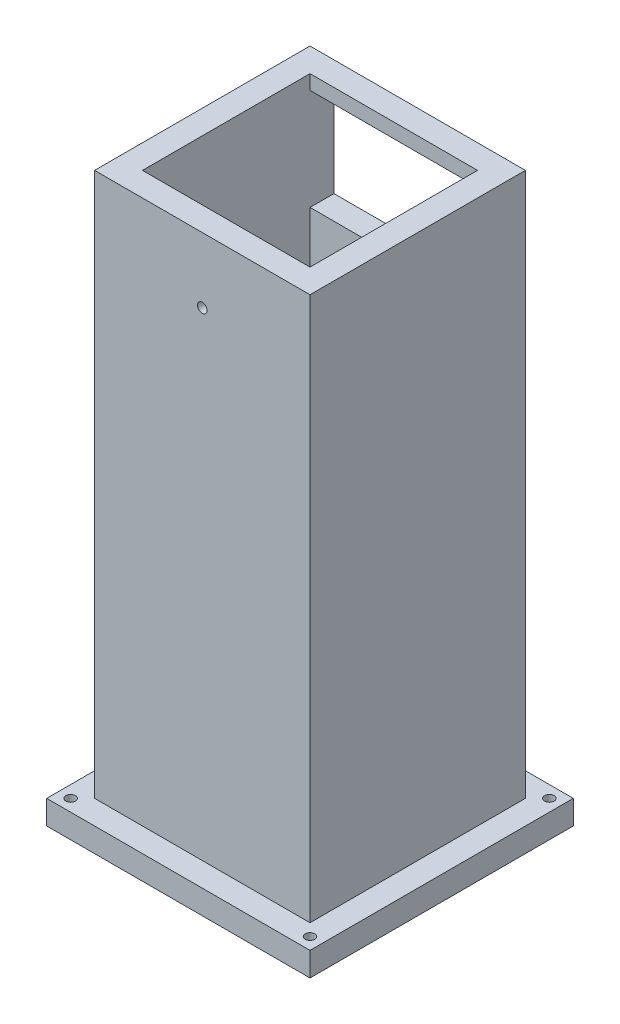
ISO-10303-21;
HEADER;
FILE_DESCRIPTION(('STEP AP214'),'2;1');
FILE_NAME('part.step','',(''),(''),'','','');
FILE_SCHEMA(('AUTOMOTIVE_DESIGN { 1 0 10303 214 1 1 1 1 }'));
ENDSEC;
DATA;
#1=APPLICATION_CONTEXT('core data for automotive mechanical design processes');
#2=APPLICATION_PROTOCOL_DEFINITION('international standard','automotive_design',2000,#1);
#3=PRODUCT_CONTEXT('',#1,'mechanical');
#4=PRODUCT('Part','Part','',(#3));
#5=PRODUCT_RELATED_PRODUCT_CATEGORY('part','',(#4));
#6=PRODUCT_DEFINITION_FORMATION('','',#4);
#7=PRODUCT_DEFINITION_CONTEXT('part definition',#1,'design');
#8=PRODUCT_DEFINITION('design','',#6,#7);
#9=PRODUCT_DEFINITION_SHAPE('','',#8);
#10=(LENGTH_UNIT() NAMED_UNIT(*) SI_UNIT(.MILLI.,.METRE.));
#11=(NAMED_UNIT(*) PLANE_ANGLE_UNIT() SI_UNIT($,.RADIAN.));
#12=(NAMED_UNIT(*) SI_UNIT($,.STERADIAN.) SOLID_ANGLE_UNIT());
#13=UNCERTAINTY_MEASURE_WITH_UNIT(LENGTH_MEASURE(1.E-05),#10,'distance_accuracy_value','');
#14=(GEOMETRIC_REPRESENTATION_CONTEXT(3) GLOBAL_UNCERTAINTY_ASSIGNED_CONTEXT((#13)) GLOBAL_UNIT_ASSIGNED_CONTEXT((#10,
#11,#12)) REPRESENTATION_CONTEXT('',''));
#15=CARTESIAN_POINT('',(0.,0.,0.));
#16=DIRECTION('',(0.,0.,1.));
#17=DIRECTION('',(1.,0.,0.));
#18=AXIS2_PLACEMENT_3D('',#15,#16,#17);
#19=CARTESIAN_POINT('',(-17.5,0.,-17.5));
#20=DIRECTION('',(0.,0.,1.));
#21=DIRECTION('',(1.,0.,0.));
#22=AXIS2_PLACEMENT_3D('',#19,#20,#21);
#23=PLANE('',#22);
#24=DIRECTION('',(1.,0.,0.));
#25=VECTOR('',#24,1.);
#26=CARTESIAN_POINT('',(-17.5,273.612120728358,-17.5));
#27=LINE('',#26,#25);
#28=CARTESIAN_POINT('',(-17.5,273.612120728358,-17.5));
#29=VERTEX_POINT('',#28);
#30=CARTESIAN_POINT('',(17.5,273.612120728358,-17.5));
#31=VERTEX_POINT('',#30);
#32=EDGE_CURVE('E228',#29,#31,#27,.T.);
#33=ORIENTED_EDGE('',*,*,#32,.F.);
#34=DIRECTION('',(0.,1.,0.));
#35=VECTOR('',#34,1.);
#36=CARTESIAN_POINT('',(-17.5,0.,-17.5));
#37=LINE('',#36,#35);
#38=CARTESIAN_POINT('',(-17.5,270.587205010945,-17.5));
#39=VERTEX_POINT('',#38);
#40=EDGE_CURVE('E260',#39,#29,#37,.T.);
#41=ORIENTED_EDGE('',*,*,#40,.F.);
#42=DIRECTION('',(1.,0.,0.));
#43=VECTOR('',#42,1.);
#44=CARTESIAN_POINT('',(-17.5,270.587205010945,-17.5));
#45=LINE('',#44,#43);
#46=CARTESIAN_POINT('',(17.5,270.587205010945,-17.5));
#47=VERTEX_POINT('',#46);
#48=EDGE_CURVE('E274',#39,#47,#45,.T.);
#49=ORIENTED_EDGE('',*,*,#48,.T.);
#50=DIRECTION('',(0.,1.,0.));
#51=VECTOR('',#50,1.);
#52=CARTESIAN_POINT('',(17.5,0.,-17.5));
#53=LINE('',#52,#51);
#54=EDGE_CURVE('E257',#47,#31,#53,.T.);
#55=ORIENTED_EDGE('',*,*,#54,.T.);
#56=EDGE_LOOP('',(#33,#41,#49,#55));
#57=FACE_BOUND('',#56,.T.);
#58=ADVANCED_FACE('F39',(#57),#23,.T.);
#59=CARTESIAN_POINT('',(22.5,300.,22.5));
#60=DIRECTION('',(-1.,0.,0.));
#61=DIRECTION('',(0.,0.,1.));
#62=AXIS2_PLACEMENT_3D('',#59,#60,#61);
#63=PLANE('',#62);
#64=DIRECTION('',(0.,-1.,0.));
#65=VECTOR('',#64,1.);
#66=CARTESIAN_POINT('',(22.5,300.,22.5));
#67=LINE('',#66,#65);
#68=CARTESIAN_POINT('',(22.5,273.612120728358,22.5));
#69=VERTEX_POINT('',#68);
#70=CARTESIAN_POINT('',(22.5,160.,22.5));
#71=VERTEX_POINT('',#70);
#72=EDGE_CURVE('E263',#69,#71,#67,.T.);
#73=ORIENTED_EDGE('',*,*,#72,.T.);
#74=DIRECTION('',(0.,0.,1.));
#75=VECTOR('',#74,1.);
#76=CARTESIAN_POINT('',(22.5,160.,22.5));
#77=LINE('',#76,#75);
#78=CARTESIAN_POINT('',(22.5,160.,-22.5));
#79=VERTEX_POINT('',#78);
#80=EDGE_CURVE('E193',#79,#71,#77,.T.);
#81=ORIENTED_EDGE('',*,*,#80,.F.);
#82=DIRECTION('',(0.,-1.,0.));
#83=VECTOR('',#82,1.);
#84=CARTESIAN_POINT('',(22.5,300.,-22.5));
#85=LINE('',#84,#83);
#86=CARTESIAN_POINT('',(22.5,273.612120728358,-22.5));
#87=VERTEX_POINT('',#86);
#88=EDGE_CURVE('E271',#87,#79,#85,.T.);
#89=ORIENTED_EDGE('',*,*,#88,.F.);
#90=DIRECTION('',(0.,0.,1.));
#91=VECTOR('',#90,1.);
#92=CARTESIAN_POINT('',(22.5,273.612120728358,-22.5));
#93=LINE('',#92,#91);
#94=EDGE_CURVE('E220',#87,#69,#93,.T.);
#95=ORIENTED_EDGE('',*,*,#94,.T.);
#96=EDGE_LOOP('',(#73,#81,#89,#95));
#97=FACE_BOUND('',#96,.T.);
#98=ADVANCED_FACE('F41',(#97),#63,.F.);
#99=CARTESIAN_POINT('',(-22.5,300.,-22.5));
#100=DIRECTION('',(0.,0.,1.));
#101=DIRECTION('',(1.,0.,0.));
#102=AXIS2_PLACEMENT_3D('',#99,#100,#101);
#103=PLANE('',#102);
#104=DIRECTION('',(0.,1.,0.));
#105=VECTOR('',#104,1.);
#106=CARTESIAN_POINT('',(-17.5,249.412794989055,-22.5));
#107=LINE('',#106,#105);
#108=CARTESIAN_POINT('',(-17.5,249.412794989055,-22.5));
#109=VERTEX_POINT('',#108);
#110=CARTESIAN_POINT('',(-17.5,270.587205010945,-22.5));
#111=VERTEX_POINT('',#110);
#112=EDGE_CURVE('E236',#109,#111,#107,.T.);
#113=ORIENTED_EDGE('',*,*,#112,.F.);
#114=DIRECTION('',(-1.,0.,0.));
#115=VECTOR('',#114,1.);
#116=CARTESIAN_POINT('',(17.5,249.412794989055,-22.5));
#117=LINE('',#116,#115);
#118=CARTESIAN_POINT('',(17.5,249.412794989055,-22.5));
#119=VERTEX_POINT('',#118);
#120=EDGE_CURVE('E234',#119,#109,#117,.T.);
#121=ORIENTED_EDGE('',*,*,#120,.F.);
#122=DIRECTION('',(0.,1.,0.));
#123=VECTOR('',#122,1.);
#124=CARTESIAN_POINT('',(17.5,249.412794989055,-22.5));
#125=LINE('',#124,#123);
#126=CARTESIAN_POINT('',(17.5,270.587205010945,-22.5));
#127=VERTEX_POINT('',#126);
#128=EDGE_CURVE('E242',#119,#127,#125,.T.);
#129=ORIENTED_EDGE('',*,*,#128,.T.);
#130=DIRECTION('',(-1.,0.,0.));
#131=VECTOR('',#130,1.);
#132=CARTESIAN_POINT('',(17.5,270.587205010945,-22.5));
#133=LINE('',#132,#131);
#134=EDGE_CURVE('E239',#127,#111,#133,.T.);
#135=ORIENTED_EDGE('',*,*,#134,.T.);
#136=EDGE_LOOP('',(#113,#121,#129,#135));
#137=FACE_BOUND('',#136,.T.);
#138=ORIENTED_EDGE('',*,*,#88,.T.);
#139=DIRECTION('',(1.,0.,0.));
#140=VECTOR('',#139,1.);
#141=CARTESIAN_POINT('',(-22.5,160.,-22.5));
#142=LINE('',#141,#140);
#143=CARTESIAN_POINT('',(-22.5,160.,-22.5));
#144=VERTEX_POINT('',#143);
#145=EDGE_CURVE('E202',#144,#79,#142,.T.);
#146=ORIENTED_EDGE('',*,*,#145,.F.);
#147=DIRECTION('',(0.,-1.,0.));
#148=VECTOR('',#147,1.);
#149=CARTESIAN_POINT('',(-22.5,300.,-22.5));
#150=LINE('',#149,#148);
#151=CARTESIAN_POINT('',(-22.5,273.612120728358,-22.5));
#152=VERTEX_POINT('',#151);
#153=EDGE_CURVE('E268',#152,#144,#150,.T.);
#154=ORIENTED_EDGE('',*,*,#153,.F.);
#155=DIRECTION('',(1.,0.,0.));
#156=VECTOR('',#155,1.);
#157=CARTESIAN_POINT('',(-22.5,273.612120728358,-22.5));
#158=LINE('',#157,#156);
#159=EDGE_CURVE('E216',#152,#87,#158,.T.);
#160=ORIENTED_EDGE('',*,*,#159,.T.);
#161=EDGE_LOOP('',(#138,#146,#154,#160));
#162=FACE_BOUND('',#161,.T.);
#163=ADVANCED_FACE('F309',(#137,#162),#103,.F.);
#164=CARTESIAN_POINT('',(-22.5,300.,22.5));
#165=DIRECTION('',(1.,0.,0.));
#166=DIRECTION('',(0.,0.,-1.));
#167=AXIS2_PLACEMENT_3D('',#164,#165,#166);
#168=PLANE('',#167);
#169=ORIENTED_EDGE('',*,*,#153,.T.);
#170=DIRECTION('',(0.,0.,1.));
#171=VECTOR('',#170,1.);
#172=CARTESIAN_POINT('',(-22.5,160.,22.5));
#173=LINE('',#172,#171);
#174=CARTESIAN_POINT('',(-22.5,160.,22.5));
#175=VERTEX_POINT('',#174);
#176=EDGE_CURVE('E200',#144,#175,#173,.T.);
#177=ORIENTED_EDGE('',*,*,#176,.T.);
#178=DIRECTION('',(0.,-1.,0.));
#179=VECTOR('',#178,1.);
#180=CARTESIAN_POINT('',(-22.5,300.,22.5));
#181=LINE('',#180,#179);
#182=CARTESIAN_POINT('',(-22.5,273.612120728358,22.5));
#183=VERTEX_POINT('',#182);
#184=EDGE_CURVE('E265',#183,#175,#181,.T.);
#185=ORIENTED_EDGE('',*,*,#184,.F.);
#186=DIRECTION('',(0.,0.,1.));
#187=VECTOR('',#186,1.);
#188=CARTESIAN_POINT('',(-22.5,273.612120728358,-22.5));
#189=LINE('',#188,#187);
#190=EDGE_CURVE('E54',#152,#183,#189,.T.);
#191=ORIENTED_EDGE('',*,*,#190,.F.);
#192=EDGE_LOOP('',(#169,#177,#185,#191));
#193=FACE_BOUND('',#192,.T.);
#194=ADVANCED_FACE('F384',(#193),#168,.F.);
#195=CARTESIAN_POINT('',(-22.5,300.,22.5));
#196=DIRECTION('',(0.,0.,-1.));
#197=DIRECTION('',(-1.,0.,0.));
#198=AXIS2_PLACEMENT_3D('',#195,#196,#197);
#199=PLANE('',#198);
#200=CARTESIAN_POINT('',(0.,260.,22.5));
#201=DIRECTION('',(0.,0.,1.));
#202=DIRECTION('',(1.,0.,0.));
#203=AXIS2_PLACEMENT_3D('',#200,#201,#202);
#204=CIRCLE('',#203,1.);
#205=CARTESIAN_POINT('',(1.,260.,22.5));
#206=VERTEX_POINT('',#205);
#207=EDGE_CURVE('E230',#206,#206,#204,.T.);
#208=ORIENTED_EDGE('',*,*,#207,.F.);
#209=EDGE_LOOP('',(#208));
#210=FACE_BOUND('',#209,.T.);
#211=ORIENTED_EDGE('',*,*,#184,.T.);
#212=DIRECTION('',(1.,0.,0.));
#213=VECTOR('',#212,1.);
#214=CARTESIAN_POINT('',(-22.5,160.,22.5));
#215=LINE('',#214,#213);
#216=EDGE_CURVE('E203',#175,#71,#215,.T.);
#217=ORIENTED_EDGE('',*,*,#216,.T.);
#218=ORIENTED_EDGE('',*,*,#72,.F.);
#219=DIRECTION('',(1.,0.,0.));
#220=VECTOR('',#219,1.);
#221=CARTESIAN_POINT('',(-22.5,273.612120728358,22.5));
#222=LINE('',#221,#220);
#223=EDGE_CURVE('E215',#183,#69,#222,.T.);
#224=ORIENTED_EDGE('',*,*,#223,.F.);
#225=EDGE_LOOP('',(#211,#217,#218,#224));
#226=FACE_BOUND('',#225,.T.);
#227=ADVANCED_FACE('F381',(#210,#226),#199,.F.);
#228=CARTESIAN_POINT('',(-17.5,0.,17.5));
#229=DIRECTION('',(1.,0.,0.));
#230=DIRECTION('',(0.,0.,-1.));
#231=AXIS2_PLACEMENT_3D('',#228,#229,#230);
#232=PLANE('',#231);
#233=DIRECTION('',(0.,0.,1.));
#234=VECTOR('',#233,1.);
#235=CARTESIAN_POINT('',(-17.5,160.,17.5));
#236=LINE('',#235,#234);
#237=CARTESIAN_POINT('',(-17.5,160.,-17.5));
#238=VERTEX_POINT('',#237);
#239=CARTESIAN_POINT('',(-17.5,160.,17.5));
#240=VERTEX_POINT('',#239);
#241=EDGE_CURVE('E210',#238,#240,#236,.T.);
#242=ORIENTED_EDGE('',*,*,#241,.F.);
#243=CARTESIAN_POINT('',(-17.5,249.412794989055,-17.5));
#244=VERTEX_POINT('',#243);
#245=EDGE_CURVE('E261',#238,#244,#37,.T.);
#246=ORIENTED_EDGE('',*,*,#245,.T.);
#247=DIRECTION('',(0.,0.,-1.));
#248=VECTOR('',#247,1.);
#249=CARTESIAN_POINT('',(-17.5,249.412794989055,-12.5));
#250=LINE('',#249,#248);
#251=EDGE_CURVE('E245',#244,#109,#250,.T.);
#252=ORIENTED_EDGE('',*,*,#251,.T.);
#253=ORIENTED_EDGE('',*,*,#112,.T.);
#254=DIRECTION('',(0.,0.,-1.));
#255=VECTOR('',#254,1.);
#256=CARTESIAN_POINT('',(-17.5,270.587205010945,-12.5));
#257=LINE('',#256,#255);
#258=EDGE_CURVE('E251',#39,#111,#257,.T.);
#259=ORIENTED_EDGE('',*,*,#258,.F.);
#260=ORIENTED_EDGE('',*,*,#40,.T.);
#261=DIRECTION('',(0.,0.,-1.));
#262=VECTOR('',#261,1.);
#263=CARTESIAN_POINT('',(-17.5,273.612120728358,17.5));
#264=LINE('',#263,#262);
#265=CARTESIAN_POINT('',(-17.5,273.612120728358,17.5));
#266=VERTEX_POINT('',#265);
#267=EDGE_CURVE('E226',#266,#29,#264,.T.);
#268=ORIENTED_EDGE('',*,*,#267,.F.);
#269=DIRECTION('',(0.,1.,0.));
#270=VECTOR('',#269,1.);
#271=CARTESIAN_POINT('',(-17.5,0.,17.5));
#272=LINE('',#271,#270);
#273=EDGE_CURVE('E248',#240,#266,#272,.T.);
#274=ORIENTED_EDGE('',*,*,#273,.F.);
#275=EDGE_LOOP('',(#242,#246,#252,#253,#259,#260,#268,#274));
#276=FACE_BOUND('',#275,.T.);
#277=ADVANCED_FACE('F293',(#276),#232,.T.);
#278=CARTESIAN_POINT('',(17.5,0.,17.5));
#279=DIRECTION('',(1.,0.,0.));
#280=DIRECTION('',(0.,0.,-1.));
#281=AXIS2_PLACEMENT_3D('',#278,#279,#280);
#282=PLANE('',#281);
#283=CARTESIAN_POINT('',(17.5,160.,-17.5));
#284=VERTEX_POINT('',#283);
#285=CARTESIAN_POINT('',(17.5,249.412794989055,-17.5));
#286=VERTEX_POINT('',#285);
#287=EDGE_CURVE('E258',#284,#286,#53,.T.);
#288=ORIENTED_EDGE('',*,*,#287,.F.);
#289=DIRECTION('',(0.,0.,1.));
#290=VECTOR('',#289,1.);
#291=CARTESIAN_POINT('',(17.5,160.,17.5));
#292=LINE('',#291,#290);
#293=CARTESIAN_POINT('',(17.5,160.,17.5));
#294=VERTEX_POINT('',#293);
#295=EDGE_CURVE('E206',#284,#294,#292,.T.);
#296=ORIENTED_EDGE('',*,*,#295,.T.);
#297=DIRECTION('',(0.,1.,0.));
#298=VECTOR('',#297,1.);
#299=CARTESIAN_POINT('',(17.5,0.,17.5));
#300=LINE('',#299,#298);
#301=CARTESIAN_POINT('',(17.5,273.612120728358,17.5));
#302=VERTEX_POINT('',#301);
#303=EDGE_CURVE('E62',#294,#302,#300,.T.);
#304=ORIENTED_EDGE('',*,*,#303,.T.);
#305=DIRECTION('',(0.,0.,-1.));
#306=VECTOR('',#305,1.);
#307=CARTESIAN_POINT('',(17.5,273.612120728358,17.5));
#308=LINE('',#307,#306);
#309=EDGE_CURVE('E223',#302,#31,#308,.T.);
#310=ORIENTED_EDGE('',*,*,#309,.T.);
#311=ORIENTED_EDGE('',*,*,#54,.F.);
#312=DIRECTION('',(0.,0.,-1.));
#313=VECTOR('',#312,1.);
#314=CARTESIAN_POINT('',(17.5,270.587205010945,-12.5));
#315=LINE('',#314,#313);
#316=EDGE_CURVE('E249',#47,#127,#315,.T.);
#317=ORIENTED_EDGE('',*,*,#316,.T.);
#318=ORIENTED_EDGE('',*,*,#128,.F.);
#319=DIRECTION('',(0.,0.,-1.));
#320=VECTOR('',#319,1.);
#321=CARTESIAN_POINT('',(17.5,249.412794989055,-12.5));
#322=LINE('',#321,#320);
#323=EDGE_CURVE('E246',#286,#119,#322,.T.);
#324=ORIENTED_EDGE('',*,*,#323,.F.);
#325=EDGE_LOOP('',(#288,#296,#304,#310,#311,#317,#318,#324));
#326=FACE_BOUND('',#325,.T.);
#327=ADVANCED_FACE('F300',(#326),#282,.F.);
#328=CARTESIAN_POINT('',(-17.5,0.,17.5));
#329=DIRECTION('',(0.,0.,1.));
#330=DIRECTION('',(1.,0.,0.));
#331=AXIS2_PLACEMENT_3D('',#328,#329,#330);
#332=PLANE('',#331);
#333=CARTESIAN_POINT('',(0.,260.,17.5));
#334=DIRECTION('',(0.,0.,1.));
#335=DIRECTION('',(1.,0.,0.));
#336=AXIS2_PLACEMENT_3D('',#333,#334,#335);
#337=CIRCLE('',#336,1.);
#338=CARTESIAN_POINT('',(1.,260.,17.5));
#339=VERTEX_POINT('',#338);
#340=EDGE_CURVE('E233',#339,#339,#337,.T.);
#341=ORIENTED_EDGE('',*,*,#340,.T.);
#342=EDGE_LOOP('',(#341));
#343=FACE_BOUND('',#342,.T.);
#344=ORIENTED_EDGE('',*,*,#303,.F.);
#345=DIRECTION('',(-1.,0.,0.));
#346=VECTOR('',#345,1.);
#347=CARTESIAN_POINT('',(-17.5,160.,17.5));
#348=LINE('',#347,#346);
#349=EDGE_CURVE('E212',#294,#240,#348,.T.);
#350=ORIENTED_EDGE('',*,*,#349,.T.);
#351=ORIENTED_EDGE('',*,*,#273,.T.);
#352=DIRECTION('',(1.,0.,0.));
#353=VECTOR('',#352,1.);
#354=CARTESIAN_POINT('',(-17.5,273.612120728358,17.5));
#355=LINE('',#354,#353);
#356=EDGE_CURVE('E47',#266,#302,#355,.T.);
#357=ORIENTED_EDGE('',*,*,#356,.T.);
#358=EDGE_LOOP('',(#344,#350,#351,#357));
#359=FACE_BOUND('',#358,.T.);
#360=ADVANCED_FACE('F284',(#343,#359),#332,.F.);
#361=DIRECTION('',(-1.,0.,0.));
#362=VECTOR('',#361,1.);
#363=CARTESIAN_POINT('',(-17.5,160.,-17.5));
#364=LINE('',#363,#362);
#365=EDGE_CURVE('E11',#284,#238,#364,.T.);
#366=ORIENTED_EDGE('',*,*,#365,.F.);
#367=ORIENTED_EDGE('',*,*,#287,.T.);
#368=DIRECTION('',(1.,0.,0.));
#369=VECTOR('',#368,1.);
#370=CARTESIAN_POINT('',(-17.5,249.412794989055,-17.5));
#371=LINE('',#370,#369);
#372=EDGE_CURVE('E277',#244,#286,#371,.T.);
#373=ORIENTED_EDGE('',*,*,#372,.F.);
#374=ORIENTED_EDGE('',*,*,#245,.F.);
#375=EDGE_LOOP('',(#366,#367,#373,#374));
#376=FACE_BOUND('',#375,.T.);
#377=ADVANCED_FACE('F318',(#376),#23,.T.);
#378=CARTESIAN_POINT('',(17.5,249.412794989055,-12.5));
#379=DIRECTION('',(0.,-1.,0.));
#380=DIRECTION('',(0.,0.,-1.));
#381=AXIS2_PLACEMENT_3D('',#378,#379,#380);
#382=PLANE('',#381);
#383=ORIENTED_EDGE('',*,*,#372,.T.);
#384=ORIENTED_EDGE('',*,*,#323,.T.);
#385=ORIENTED_EDGE('',*,*,#120,.T.);
#386=ORIENTED_EDGE('',*,*,#251,.F.);
#387=EDGE_LOOP('',(#383,#384,#385,#386));
#388=FACE_BOUND('',#387,.T.);
#389=ADVANCED_FACE('F313',(#388),#382,.F.);
#390=CARTESIAN_POINT('',(17.5,270.587205010945,-12.5));
#391=DIRECTION('',(0.,-1.,0.));
#392=DIRECTION('',(0.,0.,-1.));
#393=AXIS2_PLACEMENT_3D('',#390,#391,#392);
#394=PLANE('',#393);
#395=ORIENTED_EDGE('',*,*,#258,.T.);
#396=ORIENTED_EDGE('',*,*,#134,.F.);
#397=ORIENTED_EDGE('',*,*,#316,.F.);
#398=ORIENTED_EDGE('',*,*,#48,.F.);
#399=EDGE_LOOP('',(#395,#396,#397,#398));
#400=FACE_BOUND('',#399,.T.);
#401=ADVANCED_FACE('F306',(#400),#394,.T.);
#402=CARTESIAN_POINT('',(0.,260.,12.5));
#403=DIRECTION('',(0.,0.,1.));
#404=DIRECTION('',(1.,0.,0.));
#405=AXIS2_PLACEMENT_3D('',#402,#403,#404);
#406=CYLINDRICAL_SURFACE('',#405,1.);
#407=ORIENTED_EDGE('',*,*,#207,.T.);
#408=EDGE_LOOP('',(#407));
#409=FACE_BOUND('',#408,.T.);
#410=ORIENTED_EDGE('',*,*,#340,.F.);
#411=EDGE_LOOP('',(#410));
#412=FACE_BOUND('',#411,.T.);
#413=ADVANCED_FACE('F329',(#409,#412),#406,.F.);
#414=CARTESIAN_POINT('',(-22.5,273.612120728358,-22.5));
#415=DIRECTION('',(0.,-1.,0.));
#416=DIRECTION('',(0.,0.,-1.));
#417=AXIS2_PLACEMENT_3D('',#414,#415,#416);
#418=PLANE('',#417);
#419=ORIENTED_EDGE('',*,*,#32,.T.);
#420=ORIENTED_EDGE('',*,*,#309,.F.);
#421=ORIENTED_EDGE('',*,*,#356,.F.);
#422=ORIENTED_EDGE('',*,*,#267,.T.);
#423=EDGE_LOOP('',(#419,#420,#421,#422));
#424=FACE_BOUND('',#423,.T.);
#425=ORIENTED_EDGE('',*,*,#223,.T.);
#426=ORIENTED_EDGE('',*,*,#94,.F.);
#427=ORIENTED_EDGE('',*,*,#159,.F.);
#428=ORIENTED_EDGE('',*,*,#190,.T.);
#429=EDGE_LOOP('',(#425,#426,#427,#428));
#430=FACE_BOUND('',#429,.T.);
#431=ADVANCED_FACE('F288',(#424,#430),#418,.F.);
#432=CARTESIAN_POINT('',(0.,160.,0.));
#433=DIRECTION('',(0.,1.,0.));
#434=DIRECTION('',(0.,0.,1.));
#435=AXIS2_PLACEMENT_3D('',#432,#433,#434);
#436=PLANE('',#435);
#437=ORIENTED_EDGE('',*,*,#295,.F.);
#438=ORIENTED_EDGE('',*,*,#365,.T.);
#439=ORIENTED_EDGE('',*,*,#241,.T.);
#440=ORIENTED_EDGE('',*,*,#349,.F.);
#441=EDGE_LOOP('',(#437,#438,#439,#440));
#442=FACE_BOUND('',#441,.T.);
#443=ADVANCED_FACE('F320',(#442),#436,.T.);
#444=CARTESIAN_POINT('',(25.,160.,-25.));
#445=DIRECTION('',(0.,1.,0.));
#446=DIRECTION('',(0.,0.,1.));
#447=AXIS2_PLACEMENT_3D('',#444,#445,#446);
#448=CIRCLE('',#447,1.);
#449=CARTESIAN_POINT('',(25.,160.,-24.));
#450=VERTEX_POINT('',#449);
#451=EDGE_CURVE('E182',#450,#450,#448,.T.);
#452=ORIENTED_EDGE('',*,*,#451,.F.);
#453=EDGE_LOOP('',(#452));
#454=FACE_BOUND('',#453,.T.);
#455=CARTESIAN_POINT('',(-25.,160.,-25.));
#456=DIRECTION('',(0.,1.,0.));
#457=DIRECTION('',(0.,0.,1.));
#458=AXIS2_PLACEMENT_3D('',#455,#456,#457);
#459=CIRCLE('',#458,1.);
#460=CARTESIAN_POINT('',(-25.,160.,-24.));
#461=VERTEX_POINT('',#460);
#462=EDGE_CURVE('E604',#461,#461,#459,.T.);
#463=ORIENTED_EDGE('',*,*,#462,.F.);
#464=EDGE_LOOP('',(#463));
#465=FACE_BOUND('',#464,.T.);
#466=CARTESIAN_POINT('',(-25.,160.,25.));
#467=DIRECTION('',(0.,1.,0.));
#468=DIRECTION('',(0.,0.,1.));
#469=AXIS2_PLACEMENT_3D('',#466,#467,#468);
#470=CIRCLE('',#469,1.);
#471=CARTESIAN_POINT('',(-25.,160.,26.));
#472=VERTEX_POINT('',#471);
#473=EDGE_CURVE('E602',#472,#472,#470,.T.);
#474=ORIENTED_EDGE('',*,*,#473,.F.);
#475=EDGE_LOOP('',(#474));
#476=FACE_BOUND('',#475,.T.);
#477=CARTESIAN_POINT('',(25.,160.,25.));
#478=DIRECTION('',(0.,1.,0.));
#479=DIRECTION('',(0.,0.,1.));
#480=AXIS2_PLACEMENT_3D('',#477,#478,#479);
#481=CIRCLE('',#480,1.);
#482=CARTESIAN_POINT('',(25.,160.,26.));
#483=VERTEX_POINT('',#482);
#484=EDGE_CURVE('E599',#483,#483,#481,.T.);
#485=ORIENTED_EDGE('',*,*,#484,.F.);
#486=EDGE_LOOP('',(#485));
#487=FACE_BOUND('',#486,.T.);
#488=DIRECTION('',(0.,0.,1.));
#489=VECTOR('',#488,1.);
#490=CARTESIAN_POINT('',(-27.5,160.,-27.5));
#491=LINE('',#490,#489);
#492=CARTESIAN_POINT('',(-27.5,160.,-27.5));
#493=VERTEX_POINT('',#492);
#494=CARTESIAN_POINT('',(-27.5,160.,27.5));
#495=VERTEX_POINT('',#494);
#496=EDGE_CURVE('E187',#493,#495,#491,.T.);
#497=ORIENTED_EDGE('',*,*,#496,.T.);
#498=DIRECTION('',(1.,0.,0.));
#499=VECTOR('',#498,1.);
#500=CARTESIAN_POINT('',(-27.5,160.,27.5));
#501=LINE('',#500,#499);
#502=CARTESIAN_POINT('',(27.5,160.,27.5));
#503=VERTEX_POINT('',#502);
#504=EDGE_CURVE('E158',#495,#503,#501,.T.);
#505=ORIENTED_EDGE('',*,*,#504,.T.);
#506=DIRECTION('',(0.,0.,1.));
#507=VECTOR('',#506,1.);
#508=CARTESIAN_POINT('',(27.5,160.,-27.5));
#509=LINE('',#508,#507);
#510=CARTESIAN_POINT('',(27.5,160.,-27.5));
#511=VERTEX_POINT('',#510);
#512=EDGE_CURVE('E179',#511,#503,#509,.T.);
#513=ORIENTED_EDGE('',*,*,#512,.F.);
#514=DIRECTION('',(1.,0.,0.));
#515=VECTOR('',#514,1.);
#516=CARTESIAN_POINT('',(-27.5,160.,-27.5));
#517=LINE('',#516,#515);
#518=EDGE_CURVE('E177',#493,#511,#517,.T.);
#519=ORIENTED_EDGE('',*,*,#518,.F.);
#520=EDGE_LOOP('',(#497,#505,#513,#519));
#521=FACE_BOUND('',#520,.T.);
#522=ORIENTED_EDGE('',*,*,#216,.F.);
#523=ORIENTED_EDGE('',*,*,#176,.F.);
#524=ORIENTED_EDGE('',*,*,#145,.T.);
#525=ORIENTED_EDGE('',*,*,#80,.T.);
#526=EDGE_LOOP('',(#522,#523,#524,#525));
#527=FACE_BOUND('',#526,.T.);
#528=ADVANCED_FACE('F322',(#454,#465,#476,#487,#521,#527),#436,.T.);
#529=CARTESIAN_POINT('',(-27.5,155.,-27.5));
#530=DIRECTION('',(-1.,0.,0.));
#531=DIRECTION('',(0.,0.,1.));
#532=AXIS2_PLACEMENT_3D('',#529,#530,#531);
#533=PLANE('',#532);
#534=ORIENTED_EDGE('',*,*,#496,.F.);
#535=DIRECTION('',(0.,1.,0.));
#536=VECTOR('',#535,1.);
#537=CARTESIAN_POINT('',(-27.5,155.,-27.5));
#538=LINE('',#537,#536);
#539=CARTESIAN_POINT('',(-27.5,155.,-27.5));
#540=VERTEX_POINT('',#539);
#541=EDGE_CURVE('E175',#540,#493,#538,.T.);
#542=ORIENTED_EDGE('',*,*,#541,.F.);
#543=DIRECTION('',(0.,0.,1.));
#544=VECTOR('',#543,1.);
#545=CARTESIAN_POINT('',(-27.5,155.,-27.5));
#546=LINE('',#545,#544);
#547=CARTESIAN_POINT('',(-27.5,155.,27.5));
#548=VERTEX_POINT('',#547);
#549=EDGE_CURVE('E169',#540,#548,#546,.T.);
#550=ORIENTED_EDGE('',*,*,#549,.T.);
#551=DIRECTION('',(0.,1.,0.));
#552=VECTOR('',#551,1.);
#553=CARTESIAN_POINT('',(-27.5,155.,27.5));
#554=LINE('',#553,#552);
#555=EDGE_CURVE('E153',#548,#495,#554,.T.);
#556=ORIENTED_EDGE('',*,*,#555,.T.);
#557=EDGE_LOOP('',(#534,#542,#550,#556));
#558=FACE_BOUND('',#557,.T.);
#559=ADVANCED_FACE('F174',(#558),#533,.T.);
#560=CARTESIAN_POINT('',(-27.5,155.,-27.5));
#561=DIRECTION('',(0.,0.,1.));
#562=DIRECTION('',(1.,0.,0.));
#563=AXIS2_PLACEMENT_3D('',#560,#561,#562);
#564=PLANE('',#563);
#565=ORIENTED_EDGE('',*,*,#518,.T.);
#566=DIRECTION('',(0.,1.,0.));
#567=VECTOR('',#566,1.);
#568=CARTESIAN_POINT('',(27.5,155.,-27.5));
#569=LINE('',#568,#567);
#570=CARTESIAN_POINT('',(27.5,155.,-27.5));
#571=VERTEX_POINT('',#570);
#572=EDGE_CURVE('E194',#571,#511,#569,.T.);
#573=ORIENTED_EDGE('',*,*,#572,.F.);
#574=DIRECTION('',(1.,0.,0.));
#575=VECTOR('',#574,1.);
#576=CARTESIAN_POINT('',(-27.5,155.,-27.5));
#577=LINE('',#576,#575);
#578=EDGE_CURVE('E164',#540,#571,#577,.T.);
#579=ORIENTED_EDGE('',*,*,#578,.F.);
#580=ORIENTED_EDGE('',*,*,#541,.T.);
#581=EDGE_LOOP('',(#565,#573,#579,#580));
#582=FACE_BOUND('',#581,.T.);
#583=ADVANCED_FACE('F362',(#582),#564,.F.);
#584=CARTESIAN_POINT('',(27.5,155.,-27.5));
#585=DIRECTION('',(-1.,0.,0.));
#586=DIRECTION('',(0.,0.,1.));
#587=AXIS2_PLACEMENT_3D('',#584,#585,#586);
#588=PLANE('',#587);
#589=ORIENTED_EDGE('',*,*,#512,.T.);
#590=DIRECTION('',(0.,1.,0.));
#591=VECTOR('',#590,1.);
#592=CARTESIAN_POINT('',(27.5,155.,27.5));
#593=LINE('',#592,#591);
#594=CARTESIAN_POINT('',(27.5,155.,27.5));
#595=VERTEX_POINT('',#594);
#596=EDGE_CURVE('E163',#595,#503,#593,.T.);
#597=ORIENTED_EDGE('',*,*,#596,.F.);
#598=DIRECTION('',(0.,0.,1.));
#599=VECTOR('',#598,1.);
#600=CARTESIAN_POINT('',(27.5,155.,-27.5));
#601=LINE('',#600,#599);
#602=EDGE_CURVE('E171',#571,#595,#601,.T.);
#603=ORIENTED_EDGE('',*,*,#602,.F.);
#604=ORIENTED_EDGE('',*,*,#572,.T.);
#605=EDGE_LOOP('',(#589,#597,#603,#604));
#606=FACE_BOUND('',#605,.T.);
#607=ADVANCED_FACE('F365',(#606),#588,.F.);
#608=CARTESIAN_POINT('',(-27.5,155.,27.5));
#609=DIRECTION('',(0.,0.,1.));
#610=DIRECTION('',(1.,0.,0.));
#611=AXIS2_PLACEMENT_3D('',#608,#609,#610);
#612=PLANE('',#611);
#613=ORIENTED_EDGE('',*,*,#504,.F.);
#614=ORIENTED_EDGE('',*,*,#555,.F.);
#615=DIRECTION('',(1.,0.,0.));
#616=VECTOR('',#615,1.);
#617=CARTESIAN_POINT('',(-27.5,155.,27.5));
#618=LINE('',#617,#616);
#619=EDGE_CURVE('E156',#548,#595,#618,.T.);
#620=ORIENTED_EDGE('',*,*,#619,.T.);
#621=ORIENTED_EDGE('',*,*,#596,.T.);
#622=EDGE_LOOP('',(#613,#614,#620,#621));
#623=FACE_BOUND('',#622,.T.);
#624=ADVANCED_FACE('F155',(#623),#612,.T.);
#625=CARTESIAN_POINT('',(0.,155.,0.));
#626=DIRECTION('',(0.,1.,0.));
#627=DIRECTION('',(0.,0.,1.));
#628=AXIS2_PLACEMENT_3D('',#625,#626,#627);
#629=PLANE('',#628);
#630=CARTESIAN_POINT('',(25.,155.,-25.));
#631=DIRECTION('',(0.,-1.,0.));
#632=DIRECTION('',(0.,0.,-1.));
#633=AXIS2_PLACEMENT_3D('',#630,#631,#632);
#634=CIRCLE('',#633,1.);
#635=CARTESIAN_POINT('',(25.,155.,-26.));
#636=VERTEX_POINT('',#635);
#637=EDGE_CURVE('E588',#636,#636,#634,.T.);
#638=ORIENTED_EDGE('',*,*,#637,.F.);
#639=EDGE_LOOP('',(#638));
#640=FACE_BOUND('',#639,.T.);
#641=CARTESIAN_POINT('',(-25.,155.,-25.));
#642=DIRECTION('',(0.,-1.,0.));
#643=DIRECTION('',(0.,0.,-1.));
#644=AXIS2_PLACEMENT_3D('',#641,#642,#643);
#645=CIRCLE('',#644,1.);
#646=CARTESIAN_POINT('',(-25.,155.,-26.));
#647=VERTEX_POINT('',#646);
#648=EDGE_CURVE('E589',#647,#647,#645,.T.);
#649=ORIENTED_EDGE('',*,*,#648,.F.);
#650=EDGE_LOOP('',(#649));
#651=FACE_BOUND('',#650,.T.);
#652=CARTESIAN_POINT('',(-25.,155.,25.));
#653=DIRECTION('',(0.,-1.,0.));
#654=DIRECTION('',(0.,0.,-1.));
#655=AXIS2_PLACEMENT_3D('',#652,#653,#654);
#656=CIRCLE('',#655,1.);
#657=CARTESIAN_POINT('',(-25.,155.,24.));
#658=VERTEX_POINT('',#657);
#659=EDGE_CURVE('E592',#658,#658,#656,.T.);
#660=ORIENTED_EDGE('',*,*,#659,.F.);
#661=EDGE_LOOP('',(#660));
#662=FACE_BOUND('',#661,.T.);
#663=CARTESIAN_POINT('',(25.,155.,25.));
#664=DIRECTION('',(0.,-1.,0.));
#665=DIRECTION('',(0.,0.,-1.));
#666=AXIS2_PLACEMENT_3D('',#663,#664,#665);
#667=CIRCLE('',#666,1.);
#668=CARTESIAN_POINT('',(25.,155.,24.));
#669=VERTEX_POINT('',#668);
#670=EDGE_CURVE('E596',#669,#669,#667,.T.);
#671=ORIENTED_EDGE('',*,*,#670,.F.);
#672=EDGE_LOOP('',(#671));
#673=FACE_BOUND('',#672,.T.);
#674=ORIENTED_EDGE('',*,*,#549,.F.);
#675=ORIENTED_EDGE('',*,*,#578,.T.);
#676=ORIENTED_EDGE('',*,*,#602,.T.);
#677=ORIENTED_EDGE('',*,*,#619,.F.);
#678=EDGE_LOOP('',(#674,#675,#676,#677));
#679=FACE_BOUND('',#678,.T.);
#680=ADVANCED_FACE('F168',(#640,#651,#662,#673,#679),#629,.F.);
#681=CARTESIAN_POINT('',(25.,273.612120728358,25.));
#682=DIRECTION('',(0.,-1.,0.));
#683=DIRECTION('',(0.,0.,-1.));
#684=AXIS2_PLACEMENT_3D('',#681,#682,#683);
#685=CYLINDRICAL_SURFACE('',#684,1.);
#686=ORIENTED_EDGE('',*,*,#484,.T.);
#687=EDGE_LOOP('',(#686));
#688=FACE_BOUND('',#687,.T.);
#689=ORIENTED_EDGE('',*,*,#670,.T.);
#690=EDGE_LOOP('',(#689));
#691=FACE_BOUND('',#690,.T.);
#692=ADVANCED_FACE('F520',(#688,#691),#685,.F.);
#693=CARTESIAN_POINT('',(-25.,273.612120728358,25.));
#694=DIRECTION('',(0.,-1.,0.));
#695=DIRECTION('',(0.,0.,-1.));
#696=AXIS2_PLACEMENT_3D('',#693,#694,#695);
#697=CYLINDRICAL_SURFACE('',#696,1.);
#698=ORIENTED_EDGE('',*,*,#473,.T.);
#699=EDGE_LOOP('',(#698));
#700=FACE_BOUND('',#699,.T.);
#701=ORIENTED_EDGE('',*,*,#659,.T.);
#702=EDGE_LOOP('',(#701));
#703=FACE_BOUND('',#702,.T.);
#704=ADVANCED_FACE('F529',(#700,#703),#697,.F.);
#705=CARTESIAN_POINT('',(-25.,273.612120728358,-25.));
#706=DIRECTION('',(0.,-1.,0.));
#707=DIRECTION('',(0.,0.,-1.));
#708=AXIS2_PLACEMENT_3D('',#705,#706,#707);
#709=CYLINDRICAL_SURFACE('',#708,1.);
#710=ORIENTED_EDGE('',*,*,#462,.T.);
#711=EDGE_LOOP('',(#710));
#712=FACE_BOUND('',#711,.T.);
#713=ORIENTED_EDGE('',*,*,#648,.T.);
#714=EDGE_LOOP('',(#713));
#715=FACE_BOUND('',#714,.T.);
#716=ADVANCED_FACE('F539',(#712,#715),#709,.F.);
#717=CARTESIAN_POINT('',(25.,273.612120728358,-25.));
#718=DIRECTION('',(0.,-1.,0.));
#719=DIRECTION('',(0.,0.,-1.));
#720=AXIS2_PLACEMENT_3D('',#717,#718,#719);
#721=CYLINDRICAL_SURFACE('',#720,1.);
#722=ORIENTED_EDGE('',*,*,#451,.T.);
#723=EDGE_LOOP('',(#722));
#724=FACE_BOUND('',#723,.T.);
#725=ORIENTED_EDGE('',*,*,#637,.T.);
#726=EDGE_LOOP('',(#725));
#727=FACE_BOUND('',#726,.T.);
#728=ADVANCED_FACE('F549',(#724,#727),#721,.F.);
#729=CLOSED_SHELL('',(#58,#98,#163,#194,#227,#277,#327,#360,#377,#389,#401,#413,#431,#443,#528,
#559,#583,#607,#624,#680,#692,#704,#716,#728));
#730=MANIFOLD_SOLID_BREP('B2',#729);
#731=ADVANCED_BREP_SHAPE_REPRESENTATION('',(#18,#730),#14);
#732=SHAPE_DEFINITION_REPRESENTATION(#9,#731);
ENDSEC;
END-ISO-10303-21;
